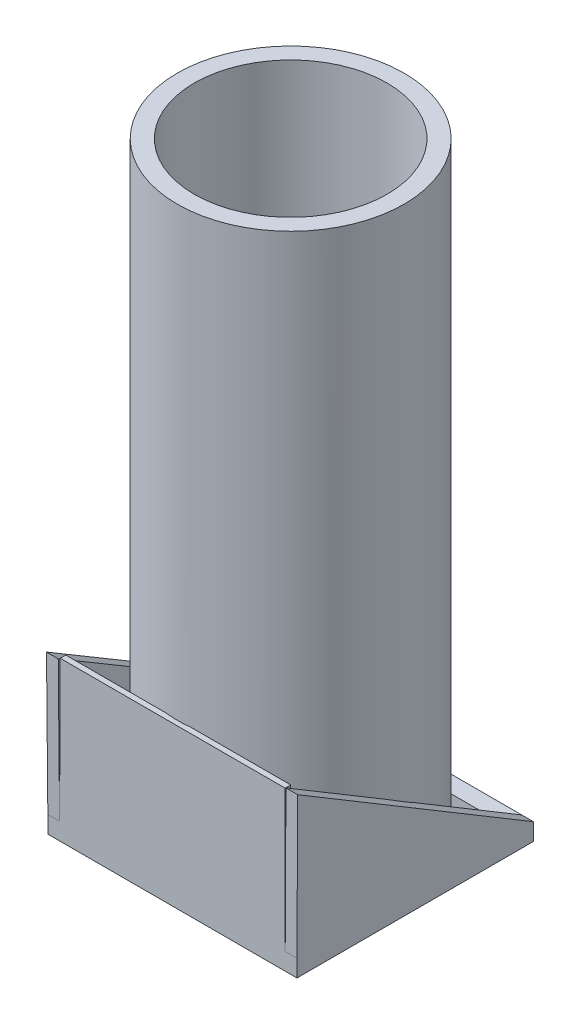
ISO-10303-21;
HEADER;
FILE_DESCRIPTION(('STEP AP214'),'2;1');
FILE_NAME('part.step','',(''),(''),'','','');
FILE_SCHEMA(('AUTOMOTIVE_DESIGN { 1 0 10303 214 1 1 1 1 }'));
ENDSEC;
DATA;
#1=APPLICATION_CONTEXT('core data for automotive mechanical design processes');
#2=APPLICATION_PROTOCOL_DEFINITION('international standard','automotive_design',2000,#1);
#3=PRODUCT_CONTEXT('',#1,'mechanical');
#4=PRODUCT('Part','Part','',(#3));
#5=PRODUCT_RELATED_PRODUCT_CATEGORY('part','',(#4));
#6=PRODUCT_DEFINITION_FORMATION('','',#4);
#7=PRODUCT_DEFINITION_CONTEXT('part definition',#1,'design');
#8=PRODUCT_DEFINITION('design','',#6,#7);
#9=PRODUCT_DEFINITION_SHAPE('','',#8);
#10=(LENGTH_UNIT() NAMED_UNIT(*) SI_UNIT(.MILLI.,.METRE.));
#11=(NAMED_UNIT(*) PLANE_ANGLE_UNIT() SI_UNIT($,.RADIAN.));
#12=(NAMED_UNIT(*) SI_UNIT($,.STERADIAN.) SOLID_ANGLE_UNIT());
#13=UNCERTAINTY_MEASURE_WITH_UNIT(LENGTH_MEASURE(1.E-05),#10,'distance_accuracy_value','');
#14=(GEOMETRIC_REPRESENTATION_CONTEXT(3) GLOBAL_UNCERTAINTY_ASSIGNED_CONTEXT((#13)) GLOBAL_UNIT_ASSIGNED_CONTEXT((#10,
#11,#12)) REPRESENTATION_CONTEXT('',''));
#15=CARTESIAN_POINT('',(0.,0.,0.));
#16=DIRECTION('',(0.,0.,1.));
#17=DIRECTION('',(1.,0.,0.));
#18=AXIS2_PLACEMENT_3D('',#15,#16,#17);
#19=CARTESIAN_POINT('',(0.,0.,0.));
#20=DIRECTION('',(0.,-1.,0.));
#21=DIRECTION('',(0.,0.,-1.));
#22=AXIS2_PLACEMENT_3D('',#19,#20,#21);
#23=PLANE('',#22);
#24=DIRECTION('',(1.,0.,0.));
#25=VECTOR('',#24,1.);
#26=CARTESIAN_POINT('',(-134.210583575948,0.,134.101535288612));
#27=LINE('',#26,#25);
#28=CARTESIAN_POINT('',(15.5492196986569,0.,134.101535288612));
#29=VERTEX_POINT('',#28);
#30=CARTESIAN_POINT('',(134.210583575948,0.,134.101535288612));
#31=VERTEX_POINT('',#30);
#32=EDGE_CURVE('E273',#29,#31,#27,.T.);
#33=ORIENTED_EDGE('',*,*,#32,.T.);
#34=DIRECTION('',(0.,0.,-1.));
#35=VECTOR('',#34,1.);
#36=CARTESIAN_POINT('',(134.210583575948,0.,140.705535288612));
#37=LINE('',#36,#35);
#38=CARTESIAN_POINT('',(134.210583575948,0.,14.5780402044796));
#39=VERTEX_POINT('',#38);
#40=EDGE_CURVE('E291',#31,#39,#37,.T.);
#41=ORIENTED_EDGE('',*,*,#40,.T.);
#42=CARTESIAN_POINT('',(0.,0.,0.));
#43=DIRECTION('',(0.,1.,0.));
#44=DIRECTION('',(0.,0.,1.));
#45=AXIS2_PLACEMENT_3D('',#42,#43,#44);
#46=CIRCLE('',#45,135.);
#47=CARTESIAN_POINT('',(127.860583575948,0.,43.3205628728202));
#48=VERTEX_POINT('',#47);
#49=EDGE_CURVE('E502',#48,#39,#46,.T.);
#50=ORIENTED_EDGE('',*,*,#49,.F.);
#51=DIRECTION('',(0.,0.,1.));
#52=VECTOR('',#51,1.);
#53=CARTESIAN_POINT('',(127.860583575948,0.,-140.705535288612));
#54=LINE('',#53,#52);
#55=CARTESIAN_POINT('',(127.860583575948,0.,120.385535288612));
#56=VERTEX_POINT('',#55);
#57=EDGE_CURVE('E399',#48,#56,#54,.T.);
#58=ORIENTED_EDGE('',*,*,#57,.T.);
#59=DIRECTION('',(-1.,0.,0.));
#60=VECTOR('',#59,1.);
#61=CARTESIAN_POINT('',(148.180583575948,0.,120.385535288612));
#62=LINE('',#61,#60);
#63=CARTESIAN_POINT('',(61.0927401028495,0.,120.385535288612));
#64=VERTEX_POINT('',#63);
#65=EDGE_CURVE('E389',#56,#64,#62,.T.);
#66=ORIENTED_EDGE('',*,*,#65,.T.);
#67=EDGE_CURVE('E497',#29,#64,#46,.T.);
#68=ORIENTED_EDGE('',*,*,#67,.F.);
#69=EDGE_LOOP('',(#33,#41,#50,#58,#66,#68));
#70=FACE_BOUND('',#69,.T.);
#71=ADVANCED_FACE('F45',(#70),#23,.F.);
#72=CARTESIAN_POINT('',(-134.210583575948,0.,134.101535288612));
#73=VERTEX_POINT('',#72);
#74=CARTESIAN_POINT('',(-15.5492196986569,0.,134.101535288612));
#75=VERTEX_POINT('',#74);
#76=EDGE_CURVE('E246',#73,#75,#27,.T.);
#77=ORIENTED_EDGE('',*,*,#76,.T.);
#78=CARTESIAN_POINT('',(-61.0927401028495,0.,120.385535288612));
#79=VERTEX_POINT('',#78);
#80=EDGE_CURVE('E503',#79,#75,#46,.T.);
#81=ORIENTED_EDGE('',*,*,#80,.F.);
#82=CARTESIAN_POINT('',(-127.860583575948,0.,120.385535288612));
#83=VERTEX_POINT('',#82);
#84=EDGE_CURVE('E394',#79,#83,#62,.T.);
#85=ORIENTED_EDGE('',*,*,#84,.T.);
#86=DIRECTION('',(0.,0.,-1.));
#87=VECTOR('',#86,1.);
#88=CARTESIAN_POINT('',(-127.860583575948,0.,-140.705535288612));
#89=LINE('',#88,#87);
#90=CARTESIAN_POINT('',(-127.860583575948,0.,43.3205628728202));
#91=VERTEX_POINT('',#90);
#92=EDGE_CURVE('E384',#83,#91,#89,.T.);
#93=ORIENTED_EDGE('',*,*,#92,.T.);
#94=CARTESIAN_POINT('',(-134.210583575948,0.,14.5780402044801));
#95=VERTEX_POINT('',#94);
#96=EDGE_CURVE('E505',#95,#91,#46,.T.);
#97=ORIENTED_EDGE('',*,*,#96,.F.);
#98=DIRECTION('',(0.,0.,-1.));
#99=VECTOR('',#98,1.);
#100=CARTESIAN_POINT('',(-134.210583575948,0.,140.705535288612));
#101=LINE('',#100,#99);
#102=EDGE_CURVE('E332',#73,#95,#101,.T.);
#103=ORIENTED_EDGE('',*,*,#102,.F.);
#104=EDGE_LOOP('',(#77,#81,#85,#93,#97,#103));
#105=FACE_BOUND('',#104,.T.);
#106=ADVANCED_FACE('F617',(#105),#23,.F.);
#107=CARTESIAN_POINT('',(0.,700.,0.));
#108=DIRECTION('',(0.,-1.,0.));
#109=DIRECTION('',(0.,0.,-1.));
#110=AXIS2_PLACEMENT_3D('',#107,#108,#109);
#111=CYLINDRICAL_SURFACE('',#110,135.);
#112=CARTESIAN_POINT('',(0.,700.,0.));
#113=DIRECTION('',(0.,1.,0.));
#114=DIRECTION('',(0.,0.,1.));
#115=AXIS2_PLACEMENT_3D('',#112,#113,#114);
#116=CIRCLE('',#115,135.);
#117=CARTESIAN_POINT('',(0.,700.,135.));
#118=VERTEX_POINT('',#117);
#119=EDGE_CURVE('E498',#118,#118,#116,.T.);
#120=ORIENTED_EDGE('',*,*,#119,.F.);
#121=EDGE_LOOP('',(#120));
#122=FACE_BOUND('',#121,.T.);
#123=DIRECTION('',(0.,-1.,0.));
#124=VECTOR('',#123,1.);
#125=CARTESIAN_POINT('',(-15.5492196986569,700.,134.101535288612));
#126=LINE('',#125,#124);
#127=CARTESIAN_POINT('',(-15.5492196986573,168.279876870145,134.101535288612));
#128=VERTEX_POINT('',#127);
#129=EDGE_CURVE('E60',#128,#75,#126,.T.);
#130=ORIENTED_EDGE('',*,*,#129,.F.);
#131=CARTESIAN_POINT('',(0.,168.279876870145,0.));
#132=DIRECTION('',(0.,1.,0.));
#133=DIRECTION('',(0.,0.,1.));
#134=AXIS2_PLACEMENT_3D('',#131,#132,#133);
#135=CIRCLE('',#134,135.);
#136=CARTESIAN_POINT('',(15.5492196986569,168.279876870145,134.101535288612));
#137=VERTEX_POINT('',#136);
#138=EDGE_CURVE('E11',#128,#137,#135,.T.);
#139=ORIENTED_EDGE('',*,*,#138,.T.);
#140=DIRECTION('',(0.,-1.,0.));
#141=VECTOR('',#140,1.);
#142=CARTESIAN_POINT('',(15.5492196986569,700.,134.101535288612));
#143=LINE('',#142,#141);
#144=EDGE_CURVE('E253',#29,#137,#143,.F.);
#145=ORIENTED_EDGE('',*,*,#144,.F.);
#146=ORIENTED_EDGE('',*,*,#67,.T.);
#147=DIRECTION('',(0.,-1.,0.));
#148=VECTOR('',#147,1.);
#149=CARTESIAN_POINT('',(61.0927401028495,700.,120.385535288612));
#150=LINE('',#149,#148);
#151=CARTESIAN_POINT('',(61.0927401028495,-20.32,120.385535288612));
#152=VERTEX_POINT('',#151);
#153=EDGE_CURVE('E437',#152,#64,#150,.F.);
#154=ORIENTED_EDGE('',*,*,#153,.F.);
#155=CARTESIAN_POINT('',(0.,-20.32,0.));
#156=DIRECTION('',(0.,-1.,0.));
#157=DIRECTION('',(0.,0.,-1.));
#158=AXIS2_PLACEMENT_3D('',#155,#156,#157);
#159=CIRCLE('',#158,135.);
#160=CARTESIAN_POINT('',(127.860583575948,-20.32,43.3205628728202));
#161=VERTEX_POINT('',#160);
#162=EDGE_CURVE('E368',#152,#161,#159,.F.);
#163=ORIENTED_EDGE('',*,*,#162,.T.);
#164=DIRECTION('',(0.,-1.,0.));
#165=VECTOR('',#164,1.);
#166=CARTESIAN_POINT('',(127.860583575948,700.,43.3205628728202));
#167=LINE('',#166,#165);
#168=EDGE_CURVE('E441',#48,#161,#167,.T.);
#169=ORIENTED_EDGE('',*,*,#168,.F.);
#170=ORIENTED_EDGE('',*,*,#49,.T.);
#171=DIRECTION('',(0.,-1.,0.));
#172=VECTOR('',#171,1.);
#173=CARTESIAN_POINT('',(134.210583575948,700.,14.5780402044796));
#174=LINE('',#173,#172);
#175=CARTESIAN_POINT('',(134.210583575948,93.0399605213853,14.5780402044796));
#176=VERTEX_POINT('',#175);
#177=EDGE_CURVE('E318',#39,#176,#174,.F.);
#178=ORIENTED_EDGE('',*,*,#177,.T.);
#179=CARTESIAN_POINT('',(0.,84.3053581605304,0.));
#180=DIRECTION('',(0.,0.85781003933585,-0.513966863148421));
#181=DIRECTION('',(0.,-0.513966863148421,-0.85781003933585));
#182=AXIS2_PLACEMENT_3D('',#179,#180,#181);
#183=ELLIPSE('',#182,157.377500623008,135.);
#184=CARTESIAN_POINT('',(134.210583575948,75.5707557996754,-14.5780402044796));
#185=VERTEX_POINT('',#184);
#186=EDGE_CURVE('E311',#176,#185,#183,.T.);
#187=ORIENTED_EDGE('',*,*,#186,.T.);
#188=DIRECTION('',(0.,-1.,0.));
#189=VECTOR('',#188,1.);
#190=CARTESIAN_POINT('',(134.210583575948,700.,-14.5780402044796));
#191=LINE('',#190,#189);
#192=CARTESIAN_POINT('',(134.210583575948,0.,-14.5780402044796));
#193=VERTEX_POINT('',#192);
#194=EDGE_CURVE('E322',#185,#193,#191,.T.);
#195=ORIENTED_EDGE('',*,*,#194,.T.);
#196=CARTESIAN_POINT('',(127.860583575948,0.,-43.3205628728202));
#197=VERTEX_POINT('',#196);
#198=EDGE_CURVE('E557',#193,#197,#46,.T.);
#199=ORIENTED_EDGE('',*,*,#198,.T.);
#200=DIRECTION('',(0.,-1.,0.));
#201=VECTOR('',#200,1.);
#202=CARTESIAN_POINT('',(127.860583575948,700.,-43.3205628728202));
#203=LINE('',#202,#201);
#204=CARTESIAN_POINT('',(127.860583575948,-20.32,-43.3205628728202));
#205=VERTEX_POINT('',#204);
#206=EDGE_CURVE('E444',#205,#197,#203,.F.);
#207=ORIENTED_EDGE('',*,*,#206,.F.);
#208=CARTESIAN_POINT('',(61.0927401028495,-20.32,-120.385535288612));
#209=VERTEX_POINT('',#208);
#210=EDGE_CURVE('E362',#205,#209,#159,.F.);
#211=ORIENTED_EDGE('',*,*,#210,.T.);
#212=DIRECTION('',(0.,-1.,0.));
#213=VECTOR('',#212,1.);
#214=CARTESIAN_POINT('',(61.0927401028495,700.,-120.385535288612));
#215=LINE('',#214,#213);
#216=CARTESIAN_POINT('',(61.0927401028495,0.,-120.385535288612));
#217=VERTEX_POINT('',#216);
#218=EDGE_CURVE('E373',#209,#217,#215,.F.);
#219=ORIENTED_EDGE('',*,*,#218,.T.);
#220=CARTESIAN_POINT('',(-61.0927401028495,0.,-120.385535288612));
#221=VERTEX_POINT('',#220);
#222=EDGE_CURVE('E559',#217,#221,#46,.T.);
#223=ORIENTED_EDGE('',*,*,#222,.T.);
#224=DIRECTION('',(0.,-1.,0.));
#225=VECTOR('',#224,1.);
#226=CARTESIAN_POINT('',(-61.0927401028495,700.,-120.385535288612));
#227=LINE('',#226,#225);
#228=CARTESIAN_POINT('',(-61.0927401028495,-20.32,-120.385535288612));
#229=VERTEX_POINT('',#228);
#230=EDGE_CURVE('E424',#221,#229,#227,.T.);
#231=ORIENTED_EDGE('',*,*,#230,.T.);
#232=CARTESIAN_POINT('',(-127.860583575948,-20.32,-43.3205628728202));
#233=VERTEX_POINT('',#232);
#234=EDGE_CURVE('E363',#229,#233,#159,.F.);
#235=ORIENTED_EDGE('',*,*,#234,.T.);
#236=DIRECTION('',(0.,-1.,0.));
#237=VECTOR('',#236,1.);
#238=CARTESIAN_POINT('',(-127.860583575948,700.,-43.3205628728202));
#239=LINE('',#238,#237);
#240=CARTESIAN_POINT('',(-127.860583575948,0.,-43.3205628728202));
#241=VERTEX_POINT('',#240);
#242=EDGE_CURVE('E427',#233,#241,#239,.F.);
#243=ORIENTED_EDGE('',*,*,#242,.T.);
#244=CARTESIAN_POINT('',(-134.210583575948,0.,-14.5780402044801));
#245=VERTEX_POINT('',#244);
#246=EDGE_CURVE('E564',#241,#245,#46,.T.);
#247=ORIENTED_EDGE('',*,*,#246,.T.);
#248=DIRECTION('',(0.,-1.,0.));
#249=VECTOR('',#248,1.);
#250=CARTESIAN_POINT('',(-134.210583575948,700.,-14.5780402044807));
#251=LINE('',#250,#249);
#252=CARTESIAN_POINT('',(-134.210583575948,74.9207892330315,-14.5780402044807));
#253=VERTEX_POINT('',#252);
#254=EDGE_CURVE('E356',#253,#245,#251,.T.);
#255=ORIENTED_EDGE('',*,*,#254,.F.);
#256=CARTESIAN_POINT('',(0.,83.5802673021238,0.));
#257=DIRECTION('',(0.,-0.859757208702279,0.510702988129565));
#258=DIRECTION('',(0.,-0.510702988129565,-0.859757208702279));
#259=AXIS2_PLACEMENT_3D('',#256,#257,#258);
#260=ELLIPSE('',#259,157.021073663075,135.);
#261=CARTESIAN_POINT('',(-134.210583575948,92.2397453712157,14.5780402044807));
#262=VERTEX_POINT('',#261);
#263=EDGE_CURVE('E359',#262,#253,#260,.T.);
#264=ORIENTED_EDGE('',*,*,#263,.F.);
#265=DIRECTION('',(0.,-1.,0.));
#266=VECTOR('',#265,1.);
#267=CARTESIAN_POINT('',(-134.210583575948,700.,14.5780402044807));
#268=LINE('',#267,#266);
#269=EDGE_CURVE('E353',#95,#262,#268,.F.);
#270=ORIENTED_EDGE('',*,*,#269,.F.);
#271=ORIENTED_EDGE('',*,*,#96,.T.);
#272=DIRECTION('',(0.,-1.,0.));
#273=VECTOR('',#272,1.);
#274=CARTESIAN_POINT('',(-127.860583575948,700.,43.3205628728202));
#275=LINE('',#274,#273);
#276=CARTESIAN_POINT('',(-127.860583575948,-20.32,43.3205628728202));
#277=VERTEX_POINT('',#276);
#278=EDGE_CURVE('E430',#91,#277,#275,.T.);
#279=ORIENTED_EDGE('',*,*,#278,.T.);
#280=CARTESIAN_POINT('',(0.,-20.32,0.));
#281=DIRECTION('',(0.,-1.,0.));
#282=DIRECTION('',(0.,0.,-1.));
#283=AXIS2_PLACEMENT_3D('',#280,#281,#282);
#284=CIRCLE('',#283,135.);
#285=CARTESIAN_POINT('',(-61.0927401028495,-20.32,120.385535288612));
#286=VERTEX_POINT('',#285);
#287=EDGE_CURVE('E448',#277,#286,#284,.F.);
#288=ORIENTED_EDGE('',*,*,#287,.T.);
#289=DIRECTION('',(0.,-1.,0.));
#290=VECTOR('',#289,1.);
#291=CARTESIAN_POINT('',(-61.0927401028495,700.,120.385535288612));
#292=LINE('',#291,#290);
#293=EDGE_CURVE('E433',#79,#286,#292,.T.);
#294=ORIENTED_EDGE('',*,*,#293,.F.);
#295=ORIENTED_EDGE('',*,*,#80,.T.);
#296=EDGE_LOOP('',(#130,#139,#145,#146,#154,#163,#169,#170,#178,#187,#195,#199,#207,#211,#219,
#223,#231,#235,#243,#247,#255,#264,#270,#271,#279,#288,#294,#295));
#297=FACE_BOUND('',#296,.T.);
#298=ADVANCED_FACE('F47',(#122,#297),#111,.T.);
#299=ORIENTED_EDGE('',*,*,#198,.F.);
#300=CARTESIAN_POINT('',(134.210583575948,0.,-140.705535288612));
#301=VERTEX_POINT('',#300);
#302=EDGE_CURVE('E292',#193,#301,#37,.T.);
#303=ORIENTED_EDGE('',*,*,#302,.T.);
#304=DIRECTION('',(1.,0.,0.));
#305=VECTOR('',#304,1.);
#306=CARTESIAN_POINT('',(148.180583575948,0.,-140.705535288612));
#307=LINE('',#306,#305);
#308=CARTESIAN_POINT('',(-134.210583575948,0.,-140.705535288612));
#309=VERTEX_POINT('',#308);
#310=EDGE_CURVE('E459',#309,#301,#307,.T.);
#311=ORIENTED_EDGE('',*,*,#310,.F.);
#312=DIRECTION('',(0.,0.,-1.));
#313=VECTOR('',#312,1.);
#314=CARTESIAN_POINT('',(-134.210583575948,0.,0.));
#315=LINE('',#314,#313);
#316=EDGE_CURVE('E54',#245,#309,#315,.T.);
#317=ORIENTED_EDGE('',*,*,#316,.F.);
#318=ORIENTED_EDGE('',*,*,#246,.F.);
#319=CARTESIAN_POINT('',(-127.860583575948,0.,-120.385535288612));
#320=VERTEX_POINT('',#319);
#321=EDGE_CURVE('E367',#241,#320,#89,.T.);
#322=ORIENTED_EDGE('',*,*,#321,.T.);
#323=DIRECTION('',(1.,0.,0.));
#324=VECTOR('',#323,1.);
#325=CARTESIAN_POINT('',(148.180583575948,0.,-120.385535288612));
#326=LINE('',#325,#324);
#327=EDGE_CURVE('E400',#320,#221,#326,.T.);
#328=ORIENTED_EDGE('',*,*,#327,.T.);
#329=ORIENTED_EDGE('',*,*,#222,.F.);
#330=CARTESIAN_POINT('',(127.860583575948,0.,-120.385535288612));
#331=VERTEX_POINT('',#330);
#332=EDGE_CURVE('E388',#217,#331,#326,.T.);
#333=ORIENTED_EDGE('',*,*,#332,.T.);
#334=EDGE_CURVE('E395',#331,#197,#54,.T.);
#335=ORIENTED_EDGE('',*,*,#334,.T.);
#336=EDGE_LOOP('',(#299,#303,#311,#317,#318,#322,#328,#329,#333,#335));
#337=FACE_BOUND('',#336,.T.);
#338=ADVANCED_FACE('F524',(#337),#23,.F.);
#339=CARTESIAN_POINT('',(0.,700.,0.));
#340=DIRECTION('',(0.,1.,0.));
#341=DIRECTION('',(0.,0.,1.));
#342=AXIS2_PLACEMENT_3D('',#339,#340,#341);
#343=PLANE('',#342);
#344=CARTESIAN_POINT('',(0.,700.,0.));
#345=DIRECTION('',(0.,1.,0.));
#346=DIRECTION('',(0.,0.,1.));
#347=AXIS2_PLACEMENT_3D('',#344,#345,#346);
#348=CIRCLE('',#347,114.68);
#349=CARTESIAN_POINT('',(0.,700.,114.68));
#350=VERTEX_POINT('',#349);
#351=EDGE_CURVE('E451',#350,#350,#348,.T.);
#352=ORIENTED_EDGE('',*,*,#351,.F.);
#353=EDGE_LOOP('',(#352));
#354=FACE_BOUND('',#353,.T.);
#355=ORIENTED_EDGE('',*,*,#119,.T.);
#356=EDGE_LOOP('',(#355));
#357=FACE_BOUND('',#356,.T.);
#358=ADVANCED_FACE('F626',(#354,#357),#343,.T.);
#359=CARTESIAN_POINT('',(-148.180583575948,-20.32,-140.705535288612));
#360=DIRECTION('',(1.,0.,0.));
#361=DIRECTION('',(0.,0.,-1.));
#362=AXIS2_PLACEMENT_3D('',#359,#360,#361);
#363=PLANE('',#362);
#364=DIRECTION('',(0.,1.,0.));
#365=VECTOR('',#364,1.);
#366=CARTESIAN_POINT('',(-148.180583575948,-20.32,140.705535288612));
#367=LINE('',#366,#365);
#368=CARTESIAN_POINT('',(-148.180583575948,-20.32,140.705535288612));
#369=VERTEX_POINT('',#368);
#370=CARTESIAN_POINT('',(-148.180583575948,0.,140.705535288612));
#371=VERTEX_POINT('',#370);
#372=EDGE_CURVE('E474',#369,#371,#367,.T.);
#373=ORIENTED_EDGE('',*,*,#372,.T.);
#374=DIRECTION('',(0.,-0.999954995636517,-0.00948718617789102));
#375=VECTOR('',#374,1.);
#376=CARTESIAN_POINT('',(-148.180583575948,168.1079442,142.300478432621));
#377=LINE('',#376,#375);
#378=CARTESIAN_POINT('',(-148.180583575948,168.1079442,142.300478432621));
#379=VERTEX_POINT('',#378);
#380=EDGE_CURVE('E343',#379,#371,#377,.T.);
#381=ORIENTED_EDGE('',*,*,#380,.F.);
#382=DIRECTION('',(0.,0.510702988129565,0.859757208702279));
#383=VECTOR('',#382,1.);
#384=CARTESIAN_POINT('',(-148.180583575948,0.,-140.705535288612));
#385=LINE('',#384,#383);
#386=CARTESIAN_POINT('',(-148.180583575948,0.,-140.705535288612));
#387=VERTEX_POINT('',#386);
#388=EDGE_CURVE('E326',#387,#379,#385,.T.);
#389=ORIENTED_EDGE('',*,*,#388,.F.);
#390=DIRECTION('',(0.,1.,0.));
#391=VECTOR('',#390,1.);
#392=CARTESIAN_POINT('',(-148.180583575948,-20.32,-140.705535288612));
#393=LINE('',#392,#391);
#394=CARTESIAN_POINT('',(-148.180583575948,-20.32,-140.705535288612));
#395=VERTEX_POINT('',#394);
#396=EDGE_CURVE('E493',#395,#387,#393,.T.);
#397=ORIENTED_EDGE('',*,*,#396,.F.);
#398=DIRECTION('',(0.,0.,-1.));
#399=VECTOR('',#398,1.);
#400=CARTESIAN_POINT('',(-148.180583575948,-20.32,-140.705535288612));
#401=LINE('',#400,#399);
#402=EDGE_CURVE('E460',#369,#395,#401,.T.);
#403=ORIENTED_EDGE('',*,*,#402,.F.);
#404=EDGE_LOOP('',(#373,#381,#389,#397,#403));
#405=FACE_BOUND('',#404,.T.);
#406=ADVANCED_FACE('F532',(#405),#363,.F.);
#407=CARTESIAN_POINT('',(148.180583575948,-20.32,-140.705535288612));
#408=DIRECTION('',(0.,0.,1.));
#409=DIRECTION('',(1.,0.,0.));
#410=AXIS2_PLACEMENT_3D('',#407,#408,#409);
#411=PLANE('',#410);
#412=EDGE_CURVE('E475',#387,#309,#307,.T.);
#413=ORIENTED_EDGE('',*,*,#412,.T.);
#414=ORIENTED_EDGE('',*,*,#310,.T.);
#415=DIRECTION('',(1.,0.,0.));
#416=VECTOR('',#415,1.);
#417=CARTESIAN_POINT('',(134.210583575948,0.,-140.705535288612));
#418=LINE('',#417,#416);
#419=CARTESIAN_POINT('',(148.180583575948,0.,-140.705535288612));
#420=VERTEX_POINT('',#419);
#421=EDGE_CURVE('E300',#301,#420,#418,.T.);
#422=ORIENTED_EDGE('',*,*,#421,.T.);
#423=DIRECTION('',(0.,1.,0.));
#424=VECTOR('',#423,1.);
#425=CARTESIAN_POINT('',(148.180583575948,-20.32,-140.705535288612));
#426=LINE('',#425,#424);
#427=CARTESIAN_POINT('',(148.180583575948,-20.32,-140.705535288612));
#428=VERTEX_POINT('',#427);
#429=EDGE_CURVE('E489',#428,#420,#426,.T.);
#430=ORIENTED_EDGE('',*,*,#429,.F.);
#431=DIRECTION('',(1.,0.,0.));
#432=VECTOR('',#431,1.);
#433=CARTESIAN_POINT('',(148.180583575948,-20.32,-140.705535288612));
#434=LINE('',#433,#432);
#435=EDGE_CURVE('E464',#395,#428,#434,.T.);
#436=ORIENTED_EDGE('',*,*,#435,.F.);
#437=ORIENTED_EDGE('',*,*,#396,.T.);
#438=EDGE_LOOP('',(#413,#414,#422,#430,#436,#437));
#439=FACE_BOUND('',#438,.T.);
#440=ADVANCED_FACE('F527',(#439),#411,.F.);
#441=CARTESIAN_POINT('',(148.180583575948,-20.32,-140.705535288612));
#442=DIRECTION('',(-1.,0.,0.));
#443=DIRECTION('',(0.,0.,1.));
#444=AXIS2_PLACEMENT_3D('',#441,#442,#443);
#445=PLANE('',#444);
#446=ORIENTED_EDGE('',*,*,#429,.T.);
#447=DIRECTION('',(0.,0.513966863148421,0.85781003933585));
#448=VECTOR('',#447,1.);
#449=CARTESIAN_POINT('',(148.180583575948,0.,-140.705535288612));
#450=LINE('',#449,#448);
#451=CARTESIAN_POINT('',(148.180583575948,168.107944167296,139.866409204966));
#452=VERTEX_POINT('',#451);
#453=EDGE_CURVE('E287',#420,#452,#450,.T.);
#454=ORIENTED_EDGE('',*,*,#453,.T.);
#455=DIRECTION('',(0.,-0.999987542242961,0.00499152871194512));
#456=VECTOR('',#455,1.);
#457=CARTESIAN_POINT('',(148.180583575948,168.107944167296,139.866409204966));
#458=LINE('',#457,#456);
#459=CARTESIAN_POINT('',(148.180583575948,0.,140.705535288612));
#460=VERTEX_POINT('',#459);
#461=EDGE_CURVE('E304',#452,#460,#458,.T.);
#462=ORIENTED_EDGE('',*,*,#461,.T.);
#463=DIRECTION('',(0.,1.,0.));
#464=VECTOR('',#463,1.);
#465=CARTESIAN_POINT('',(148.180583575948,-20.32,140.705535288612));
#466=LINE('',#465,#464);
#467=CARTESIAN_POINT('',(148.180583575948,-20.32,140.705535288612));
#468=VERTEX_POINT('',#467);
#469=EDGE_CURVE('E485',#468,#460,#466,.T.);
#470=ORIENTED_EDGE('',*,*,#469,.F.);
#471=DIRECTION('',(0.,0.,1.));
#472=VECTOR('',#471,1.);
#473=CARTESIAN_POINT('',(148.180583575948,-20.32,-140.705535288612));
#474=LINE('',#473,#472);
#475=EDGE_CURVE('E468',#428,#468,#474,.T.);
#476=ORIENTED_EDGE('',*,*,#475,.F.);
#477=EDGE_LOOP('',(#446,#454,#462,#470,#476));
#478=FACE_BOUND('',#477,.T.);
#479=ADVANCED_FACE('F652',(#478),#445,.F.);
#480=CARTESIAN_POINT('',(148.180583575948,-20.32,140.705535288612));
#481=DIRECTION('',(0.,0.,-1.));
#482=DIRECTION('',(-1.,0.,0.));
#483=AXIS2_PLACEMENT_3D('',#480,#481,#482);
#484=PLANE('',#483);
#485=DIRECTION('',(-1.,0.,0.));
#486=VECTOR('',#485,1.);
#487=CARTESIAN_POINT('',(148.180583575948,0.,140.705535288612));
#488=LINE('',#487,#486);
#489=CARTESIAN_POINT('',(134.210583575948,0.,140.705535288612));
#490=VERTEX_POINT('',#489);
#491=EDGE_CURVE('E465',#460,#490,#488,.T.);
#492=ORIENTED_EDGE('',*,*,#491,.T.);
#493=DIRECTION('',(-0.00028783757142871,0.999999958574765,0.));
#494=VECTOR('',#493,1.);
#495=CARTESIAN_POINT('',(134.210583575948,0.,140.705535288612));
#496=LINE('',#495,#494);
#497=CARTESIAN_POINT('',(134.162146302863,168.279876870145,140.705535288612));
#498=VERTEX_POINT('',#497);
#499=EDGE_CURVE('E276',#490,#498,#496,.T.);
#500=ORIENTED_EDGE('',*,*,#499,.T.);
#501=DIRECTION('',(-1.,0.,0.));
#502=VECTOR('',#501,1.);
#503=CARTESIAN_POINT('',(134.162146302863,168.279876870145,140.705535288612));
#504=LINE('',#503,#502);
#505=CARTESIAN_POINT('',(-133.500855759436,168.279876870145,140.705535288612));
#506=VERTEX_POINT('',#505);
#507=EDGE_CURVE('E239',#498,#506,#504,.T.);
#508=ORIENTED_EDGE('',*,*,#507,.T.);
#509=DIRECTION('',(-0.00421750667751213,-0.999991106279164,0.));
#510=VECTOR('',#509,1.);
#511=CARTESIAN_POINT('',(-133.500855759436,168.279876870145,140.705535288612));
#512=LINE('',#511,#510);
#513=CARTESIAN_POINT('',(-134.210583575948,0.,140.705535288612));
#514=VERTEX_POINT('',#513);
#515=EDGE_CURVE('E263',#506,#514,#512,.T.);
#516=ORIENTED_EDGE('',*,*,#515,.T.);
#517=DIRECTION('',(-1.,0.,0.));
#518=VECTOR('',#517,1.);
#519=CARTESIAN_POINT('',(-134.210583575948,0.,140.705535288612));
#520=LINE('',#519,#518);
#521=EDGE_CURVE('E340',#514,#371,#520,.T.);
#522=ORIENTED_EDGE('',*,*,#521,.T.);
#523=ORIENTED_EDGE('',*,*,#372,.F.);
#524=DIRECTION('',(-1.,0.,0.));
#525=VECTOR('',#524,1.);
#526=CARTESIAN_POINT('',(148.180583575948,-20.32,140.705535288612));
#527=LINE('',#526,#525);
#528=EDGE_CURVE('E471',#468,#369,#527,.T.);
#529=ORIENTED_EDGE('',*,*,#528,.F.);
#530=ORIENTED_EDGE('',*,*,#469,.T.);
#531=EDGE_LOOP('',(#492,#500,#508,#516,#522,#523,#529,#530));
#532=FACE_BOUND('',#531,.T.);
#533=ADVANCED_FACE('F646',(#532),#484,.F.);
#534=CARTESIAN_POINT('',(0.,-20.32,0.));
#535=DIRECTION('',(0.,-1.,0.));
#536=DIRECTION('',(0.,0.,-1.));
#537=AXIS2_PLACEMENT_3D('',#534,#535,#536);
#538=PLANE('',#537);
#539=DIRECTION('',(0.,0.,-1.));
#540=VECTOR('',#539,1.);
#541=CARTESIAN_POINT('',(-127.860583575948,-20.32,-140.705535288612));
#542=LINE('',#541,#540);
#543=CARTESIAN_POINT('',(-127.860583575948,-20.32,120.385535288612));
#544=VERTEX_POINT('',#543);
#545=EDGE_CURVE('E404',#544,#277,#542,.T.);
#546=ORIENTED_EDGE('',*,*,#545,.F.);
#547=DIRECTION('',(-1.,0.,0.));
#548=VECTOR('',#547,1.);
#549=CARTESIAN_POINT('',(148.180583575948,-20.32,120.385535288612));
#550=LINE('',#549,#548);
#551=EDGE_CURVE('E418',#286,#544,#550,.T.);
#552=ORIENTED_EDGE('',*,*,#551,.F.);
#553=ORIENTED_EDGE('',*,*,#287,.F.);
#554=EDGE_LOOP('',(#546,#552,#553));
#555=FACE_BOUND('',#554,.T.);
#556=ORIENTED_EDGE('',*,*,#234,.F.);
#557=DIRECTION('',(1.,0.,0.));
#558=VECTOR('',#557,1.);
#559=CARTESIAN_POINT('',(148.180583575948,-20.32,-120.385535288612));
#560=LINE('',#559,#558);
#561=CARTESIAN_POINT('',(-127.860583575948,-20.32,-120.385535288612));
#562=VERTEX_POINT('',#561);
#563=EDGE_CURVE('E409',#562,#229,#560,.T.);
#564=ORIENTED_EDGE('',*,*,#563,.F.);
#565=EDGE_CURVE('E393',#233,#562,#542,.T.);
#566=ORIENTED_EDGE('',*,*,#565,.F.);
#567=EDGE_LOOP('',(#556,#564,#566));
#568=FACE_BOUND('',#567,.T.);
#569=ORIENTED_EDGE('',*,*,#210,.F.);
#570=DIRECTION('',(0.,0.,1.));
#571=VECTOR('',#570,1.);
#572=CARTESIAN_POINT('',(127.860583575948,-20.32,-140.705535288612));
#573=LINE('',#572,#571);
#574=CARTESIAN_POINT('',(127.860583575948,-20.32,-120.385535288612));
#575=VERTEX_POINT('',#574);
#576=EDGE_CURVE('E414',#575,#205,#573,.T.);
#577=ORIENTED_EDGE('',*,*,#576,.F.);
#578=EDGE_CURVE('E408',#209,#575,#560,.T.);
#579=ORIENTED_EDGE('',*,*,#578,.F.);
#580=EDGE_LOOP('',(#569,#577,#579));
#581=FACE_BOUND('',#580,.T.);
#582=ORIENTED_EDGE('',*,*,#162,.F.);
#583=CARTESIAN_POINT('',(127.860583575948,-20.32,120.385535288612));
#584=VERTEX_POINT('',#583);
#585=EDGE_CURVE('E379',#584,#152,#550,.T.);
#586=ORIENTED_EDGE('',*,*,#585,.F.);
#587=EDGE_CURVE('E413',#161,#584,#573,.T.);
#588=ORIENTED_EDGE('',*,*,#587,.F.);
#589=EDGE_LOOP('',(#582,#586,#588));
#590=FACE_BOUND('',#589,.T.);
#591=ORIENTED_EDGE('',*,*,#402,.T.);
#592=ORIENTED_EDGE('',*,*,#435,.T.);
#593=ORIENTED_EDGE('',*,*,#475,.T.);
#594=ORIENTED_EDGE('',*,*,#528,.T.);
#595=EDGE_LOOP('',(#591,#592,#593,#594));
#596=FACE_BOUND('',#595,.T.);
#597=ADVANCED_FACE('F585',(#555,#568,#581,#590,#596),#538,.T.);
#598=CARTESIAN_POINT('',(0.,700.,0.));
#599=DIRECTION('',(0.,-1.,0.));
#600=DIRECTION('',(0.,0.,-1.));
#601=AXIS2_PLACEMENT_3D('',#598,#599,#600);
#602=CYLINDRICAL_SURFACE('',#601,114.68);
#603=ORIENTED_EDGE('',*,*,#351,.T.);
#604=EDGE_LOOP('',(#603));
#605=FACE_BOUND('',#604,.T.);
#606=CARTESIAN_POINT('',(0.,0.,0.));
#607=DIRECTION('',(0.,-1.,0.));
#608=DIRECTION('',(0.,0.,-1.));
#609=AXIS2_PLACEMENT_3D('',#606,#607,#608);
#610=CIRCLE('',#609,114.68);
#611=CARTESIAN_POINT('',(0.,0.,-114.68));
#612=VERTEX_POINT('',#611);
#613=EDGE_CURVE('E455',#612,#612,#610,.F.);
#614=ORIENTED_EDGE('',*,*,#613,.F.);
#615=EDGE_LOOP('',(#614));
#616=FACE_BOUND('',#615,.T.);
#617=ADVANCED_FACE('F877',(#605,#616),#602,.F.);
#618=CARTESIAN_POINT('',(0.,0.,0.));
#619=DIRECTION('',(0.,-1.,0.));
#620=DIRECTION('',(0.,0.,-1.));
#621=AXIS2_PLACEMENT_3D('',#618,#619,#620);
#622=PLANE('',#621);
#623=ORIENTED_EDGE('',*,*,#613,.T.);
#624=EDGE_LOOP('',(#623));
#625=FACE_BOUND('',#624,.T.);
#626=ADVANCED_FACE('F831',(#625),#622,.F.);
#627=CARTESIAN_POINT('',(-127.860583575948,-20.32,-140.705535288612));
#628=DIRECTION('',(1.,0.,0.));
#629=DIRECTION('',(0.,0.,-1.));
#630=AXIS2_PLACEMENT_3D('',#627,#628,#629);
#631=PLANE('',#630);
#632=ORIENTED_EDGE('',*,*,#92,.F.);
#633=DIRECTION('',(0.,1.,0.));
#634=VECTOR('',#633,1.);
#635=CARTESIAN_POINT('',(-127.860583575948,-20.32,120.385535288612));
#636=LINE('',#635,#634);
#637=EDGE_CURVE('E375',#544,#83,#636,.T.);
#638=ORIENTED_EDGE('',*,*,#637,.F.);
#639=ORIENTED_EDGE('',*,*,#545,.T.);
#640=ORIENTED_EDGE('',*,*,#278,.F.);
#641=EDGE_LOOP('',(#632,#638,#639,#640));
#642=FACE_BOUND('',#641,.T.);
#643=ADVANCED_FACE('F824',(#642),#631,.T.);
#644=CARTESIAN_POINT('',(148.180583575948,-20.32,120.385535288612));
#645=DIRECTION('',(0.,0.,-1.));
#646=DIRECTION('',(-1.,0.,0.));
#647=AXIS2_PLACEMENT_3D('',#644,#645,#646);
#648=PLANE('',#647);
#649=ORIENTED_EDGE('',*,*,#293,.T.);
#650=ORIENTED_EDGE('',*,*,#551,.T.);
#651=ORIENTED_EDGE('',*,*,#637,.T.);
#652=ORIENTED_EDGE('',*,*,#84,.F.);
#653=EDGE_LOOP('',(#649,#650,#651,#652));
#654=FACE_BOUND('',#653,.T.);
#655=ADVANCED_FACE('F819',(#654),#648,.T.);
#656=ORIENTED_EDGE('',*,*,#153,.T.);
#657=ORIENTED_EDGE('',*,*,#65,.F.);
#658=DIRECTION('',(0.,1.,0.));
#659=VECTOR('',#658,1.);
#660=CARTESIAN_POINT('',(127.860583575948,-20.32,120.385535288612));
#661=LINE('',#660,#659);
#662=EDGE_CURVE('E378',#584,#56,#661,.T.);
#663=ORIENTED_EDGE('',*,*,#662,.F.);
#664=ORIENTED_EDGE('',*,*,#585,.T.);
#665=EDGE_LOOP('',(#656,#657,#663,#664));
#666=FACE_BOUND('',#665,.T.);
#667=ADVANCED_FACE('F614',(#666),#648,.T.);
#668=CARTESIAN_POINT('',(127.860583575948,-20.32,-140.705535288612));
#669=DIRECTION('',(-1.,0.,0.));
#670=DIRECTION('',(0.,0.,1.));
#671=AXIS2_PLACEMENT_3D('',#668,#669,#670);
#672=PLANE('',#671);
#673=ORIENTED_EDGE('',*,*,#168,.T.);
#674=ORIENTED_EDGE('',*,*,#587,.T.);
#675=ORIENTED_EDGE('',*,*,#662,.T.);
#676=ORIENTED_EDGE('',*,*,#57,.F.);
#677=EDGE_LOOP('',(#673,#674,#675,#676));
#678=FACE_BOUND('',#677,.T.);
#679=ADVANCED_FACE('F603',(#678),#672,.T.);
#680=CARTESIAN_POINT('',(148.180583575948,-20.32,-120.385535288612));
#681=DIRECTION('',(0.,0.,1.));
#682=DIRECTION('',(1.,0.,0.));
#683=AXIS2_PLACEMENT_3D('',#680,#681,#682);
#684=PLANE('',#683);
#685=ORIENTED_EDGE('',*,*,#578,.T.);
#686=DIRECTION('',(0.,1.,0.));
#687=VECTOR('',#686,1.);
#688=CARTESIAN_POINT('',(127.860583575948,-20.32,-120.385535288612));
#689=LINE('',#688,#687);
#690=EDGE_CURVE('E374',#575,#331,#689,.T.);
#691=ORIENTED_EDGE('',*,*,#690,.T.);
#692=ORIENTED_EDGE('',*,*,#332,.F.);
#693=ORIENTED_EDGE('',*,*,#218,.F.);
#694=EDGE_LOOP('',(#685,#691,#692,#693));
#695=FACE_BOUND('',#694,.T.);
#696=ADVANCED_FACE('F597',(#695),#684,.T.);
#697=ORIENTED_EDGE('',*,*,#206,.T.);
#698=ORIENTED_EDGE('',*,*,#334,.F.);
#699=ORIENTED_EDGE('',*,*,#690,.F.);
#700=ORIENTED_EDGE('',*,*,#576,.T.);
#701=EDGE_LOOP('',(#697,#698,#699,#700));
#702=FACE_BOUND('',#701,.T.);
#703=ADVANCED_FACE('F599',(#702),#672,.T.);
#704=ORIENTED_EDGE('',*,*,#327,.F.);
#705=DIRECTION('',(0.,1.,0.));
#706=VECTOR('',#705,1.);
#707=CARTESIAN_POINT('',(-127.860583575948,-20.32,-120.385535288612));
#708=LINE('',#707,#706);
#709=EDGE_CURVE('E369',#562,#320,#708,.T.);
#710=ORIENTED_EDGE('',*,*,#709,.F.);
#711=ORIENTED_EDGE('',*,*,#563,.T.);
#712=ORIENTED_EDGE('',*,*,#230,.F.);
#713=EDGE_LOOP('',(#704,#710,#711,#712));
#714=FACE_BOUND('',#713,.T.);
#715=ADVANCED_FACE('F601',(#714),#684,.T.);
#716=ORIENTED_EDGE('',*,*,#565,.T.);
#717=ORIENTED_EDGE('',*,*,#709,.T.);
#718=ORIENTED_EDGE('',*,*,#321,.F.);
#719=ORIENTED_EDGE('',*,*,#242,.F.);
#720=EDGE_LOOP('',(#716,#717,#718,#719));
#721=FACE_BOUND('',#720,.T.);
#722=ADVANCED_FACE('F608',(#721),#631,.T.);
#723=CARTESIAN_POINT('',(-134.210583575948,0.,-140.705535288612));
#724=DIRECTION('',(0.,-0.859757208702279,0.510702988129565));
#725=DIRECTION('',(0.,-0.510702988129565,-0.859757208702279));
#726=AXIS2_PLACEMENT_3D('',#723,#724,#725);
#727=PLANE('',#726);
#728=DIRECTION('',(0.,0.510702988129565,0.859757208702279));
#729=VECTOR('',#728,1.);
#730=CARTESIAN_POINT('',(-134.210583575948,0.,-140.705535288612));
#731=LINE('',#730,#729);
#732=CARTESIAN_POINT('',(-134.210583575948,168.1079442,142.300478432621));
#733=VERTEX_POINT('',#732);
#734=EDGE_CURVE('E331',#262,#733,#731,.T.);
#735=ORIENTED_EDGE('',*,*,#734,.F.);
#736=ORIENTED_EDGE('',*,*,#263,.T.);
#737=EDGE_CURVE('E333',#309,#253,#731,.T.);
#738=ORIENTED_EDGE('',*,*,#737,.F.);
#739=ORIENTED_EDGE('',*,*,#412,.F.);
#740=ORIENTED_EDGE('',*,*,#388,.T.);
#741=DIRECTION('',(-1.,0.,0.));
#742=VECTOR('',#741,1.);
#743=CARTESIAN_POINT('',(-134.210583575948,168.1079442,142.300478432621));
#744=LINE('',#743,#742);
#745=EDGE_CURVE('E349',#733,#379,#744,.T.);
#746=ORIENTED_EDGE('',*,*,#745,.F.);
#747=EDGE_LOOP('',(#735,#736,#738,#739,#740,#746));
#748=FACE_BOUND('',#747,.T.);
#749=ADVANCED_FACE('F518',(#748),#727,.F.);
#750=CARTESIAN_POINT('',(-134.210583575948,0.,0.));
#751=DIRECTION('',(-1.,0.,0.));
#752=DIRECTION('',(0.,0.,1.));
#753=AXIS2_PLACEMENT_3D('',#750,#751,#752);
#754=PLANE('',#753);
#755=ORIENTED_EDGE('',*,*,#737,.T.);
#756=ORIENTED_EDGE('',*,*,#254,.T.);
#757=ORIENTED_EDGE('',*,*,#316,.T.);
#758=EDGE_LOOP('',(#755,#756,#757));
#759=FACE_BOUND('',#758,.T.);
#760=ADVANCED_FACE('F510',(#759),#754,.F.);
#761=EDGE_CURVE('E327',#514,#73,#101,.T.);
#762=ORIENTED_EDGE('',*,*,#761,.T.);
#763=ORIENTED_EDGE('',*,*,#102,.T.);
#764=ORIENTED_EDGE('',*,*,#269,.T.);
#765=ORIENTED_EDGE('',*,*,#734,.T.);
#766=DIRECTION('',(0.,-0.999954995636517,-0.00948718617789102));
#767=VECTOR('',#766,1.);
#768=CARTESIAN_POINT('',(-134.210583575948,168.1079442,142.300478432621));
#769=LINE('',#768,#767);
#770=EDGE_CURVE('E337',#733,#514,#769,.T.);
#771=ORIENTED_EDGE('',*,*,#770,.T.);
#772=EDGE_LOOP('',(#762,#763,#764,#765,#771));
#773=FACE_BOUND('',#772,.T.);
#774=ADVANCED_FACE('F541',(#773),#754,.F.);
#775=CARTESIAN_POINT('',(-134.210583575948,168.1079442,142.300478432621));
#776=DIRECTION('',(0.,0.00948718617789102,-0.999954995636517));
#777=DIRECTION('',(0.,0.999954995636517,0.00948718617789102));
#778=AXIS2_PLACEMENT_3D('',#775,#776,#777);
#779=PLANE('',#778);
#780=ORIENTED_EDGE('',*,*,#380,.T.);
#781=ORIENTED_EDGE('',*,*,#521,.F.);
#782=ORIENTED_EDGE('',*,*,#770,.F.);
#783=ORIENTED_EDGE('',*,*,#745,.T.);
#784=EDGE_LOOP('',(#780,#781,#782,#783));
#785=FACE_BOUND('',#784,.T.);
#786=ADVANCED_FACE('F537',(#785),#779,.F.);
#787=CARTESIAN_POINT('',(134.210583575948,0.,0.));
#788=DIRECTION('',(-1.,0.,0.));
#789=DIRECTION('',(0.,0.,1.));
#790=AXIS2_PLACEMENT_3D('',#787,#788,#789);
#791=PLANE('',#790);
#792=ORIENTED_EDGE('',*,*,#194,.F.);
#793=DIRECTION('',(0.,0.513966863148421,0.85781003933585));
#794=VECTOR('',#793,1.);
#795=CARTESIAN_POINT('',(134.210583575948,0.,-140.705535288612));
#796=LINE('',#795,#794);
#797=EDGE_CURVE('E293',#301,#185,#796,.T.);
#798=ORIENTED_EDGE('',*,*,#797,.F.);
#799=ORIENTED_EDGE('',*,*,#302,.F.);
#800=EDGE_LOOP('',(#792,#798,#799));
#801=FACE_BOUND('',#800,.T.);
#802=ADVANCED_FACE('F677',(#801),#791,.T.);
#803=ORIENTED_EDGE('',*,*,#177,.F.);
#804=ORIENTED_EDGE('',*,*,#40,.F.);
#805=EDGE_CURVE('E261',#490,#31,#37,.T.);
#806=ORIENTED_EDGE('',*,*,#805,.F.);
#807=DIRECTION('',(0.,-0.999987542242961,0.00499152871194512));
#808=VECTOR('',#807,1.);
#809=CARTESIAN_POINT('',(134.210583575948,168.107944167296,139.866409204966));
#810=LINE('',#809,#808);
#811=CARTESIAN_POINT('',(134.210583575948,168.107944167296,139.866409204966));
#812=VERTEX_POINT('',#811);
#813=EDGE_CURVE('E297',#812,#490,#810,.T.);
#814=ORIENTED_EDGE('',*,*,#813,.F.);
#815=EDGE_CURVE('E290',#176,#812,#796,.T.);
#816=ORIENTED_EDGE('',*,*,#815,.F.);
#817=EDGE_LOOP('',(#803,#804,#806,#814,#816));
#818=FACE_BOUND('',#817,.T.);
#819=ADVANCED_FACE('F683',(#818),#791,.T.);
#820=CARTESIAN_POINT('',(134.210583575948,0.,-140.705535288612));
#821=DIRECTION('',(0.,0.85781003933585,-0.513966863148421));
#822=DIRECTION('',(0.,0.513966863148421,0.85781003933585));
#823=AXIS2_PLACEMENT_3D('',#820,#821,#822);
#824=PLANE('',#823);
#825=ORIENTED_EDGE('',*,*,#186,.F.);
#826=ORIENTED_EDGE('',*,*,#815,.T.);
#827=DIRECTION('',(1.,0.,0.));
#828=VECTOR('',#827,1.);
#829=CARTESIAN_POINT('',(134.210583575948,168.107944167296,139.866409204966));
#830=LINE('',#829,#828);
#831=EDGE_CURVE('E308',#812,#452,#830,.T.);
#832=ORIENTED_EDGE('',*,*,#831,.T.);
#833=ORIENTED_EDGE('',*,*,#453,.F.);
#834=ORIENTED_EDGE('',*,*,#421,.F.);
#835=ORIENTED_EDGE('',*,*,#797,.T.);
#836=EDGE_LOOP('',(#825,#826,#832,#833,#834,#835));
#837=FACE_BOUND('',#836,.T.);
#838=ADVANCED_FACE('F688',(#837),#824,.T.);
#839=CARTESIAN_POINT('',(134.210583575948,168.107944167296,139.866409204966));
#840=DIRECTION('',(0.,0.00499152871194512,0.999987542242961));
#841=DIRECTION('',(0.,-0.999987542242961,0.00499152871194512));
#842=AXIS2_PLACEMENT_3D('',#839,#840,#841);
#843=PLANE('',#842);
#844=ORIENTED_EDGE('',*,*,#461,.F.);
#845=ORIENTED_EDGE('',*,*,#831,.F.);
#846=ORIENTED_EDGE('',*,*,#813,.T.);
#847=ORIENTED_EDGE('',*,*,#491,.F.);
#848=EDGE_LOOP('',(#844,#845,#846,#847));
#849=FACE_BOUND('',#848,.T.);
#850=ADVANCED_FACE('F698',(#849),#843,.T.);
#851=CARTESIAN_POINT('',(0.,0.,134.101535288612));
#852=DIRECTION('',(0.,0.,1.));
#853=DIRECTION('',(1.,0.,0.));
#854=AXIS2_PLACEMENT_3D('',#851,#852,#853);
#855=PLANE('',#854);
#856=DIRECTION('',(-1.,0.,0.));
#857=VECTOR('',#856,1.);
#858=CARTESIAN_POINT('',(134.162146302863,168.279876870145,134.101535288612));
#859=LINE('',#858,#857);
#860=CARTESIAN_POINT('',(-133.500855759436,168.279876870145,134.101535288612));
#861=VERTEX_POINT('',#860);
#862=EDGE_CURVE('E256',#128,#861,#859,.T.);
#863=ORIENTED_EDGE('',*,*,#862,.F.);
#864=ORIENTED_EDGE('',*,*,#129,.T.);
#865=ORIENTED_EDGE('',*,*,#76,.F.);
#866=DIRECTION('',(-0.00421750667751213,-0.999991106279164,0.));
#867=VECTOR('',#866,1.);
#868=CARTESIAN_POINT('',(-133.500855759436,168.279876870145,134.101535288612));
#869=LINE('',#868,#867);
#870=EDGE_CURVE('E255',#861,#73,#869,.T.);
#871=ORIENTED_EDGE('',*,*,#870,.F.);
#872=EDGE_LOOP('',(#863,#864,#865,#871));
#873=FACE_BOUND('',#872,.T.);
#874=ADVANCED_FACE('F703',(#873),#855,.F.);
#875=ORIENTED_EDGE('',*,*,#32,.F.);
#876=ORIENTED_EDGE('',*,*,#144,.T.);
#877=CARTESIAN_POINT('',(134.162146302863,168.279876870145,134.101535288612));
#878=VERTEX_POINT('',#877);
#879=EDGE_CURVE('E237',#878,#137,#859,.T.);
#880=ORIENTED_EDGE('',*,*,#879,.F.);
#881=DIRECTION('',(-0.00028783757142871,0.999999958574765,0.));
#882=VECTOR('',#881,1.);
#883=CARTESIAN_POINT('',(134.210583575948,0.,134.101535288612));
#884=LINE('',#883,#882);
#885=EDGE_CURVE('E252',#31,#878,#884,.T.);
#886=ORIENTED_EDGE('',*,*,#885,.F.);
#887=EDGE_LOOP('',(#875,#876,#880,#886));
#888=FACE_BOUND('',#887,.T.);
#889=ADVANCED_FACE('F251',(#888),#855,.F.);
#890=CARTESIAN_POINT('',(134.210583575948,0.,134.101535288612));
#891=DIRECTION('',(0.999999958574765,0.00028783757142871,0.));
#892=DIRECTION('',(-0.00028783757142871,0.999999958574766,0.));
#893=AXIS2_PLACEMENT_3D('',#890,#891,#892);
#894=PLANE('',#893);
#895=ORIENTED_EDGE('',*,*,#499,.F.);
#896=ORIENTED_EDGE('',*,*,#805,.T.);
#897=ORIENTED_EDGE('',*,*,#885,.T.);
#898=DIRECTION('',(0.,0.,1.));
#899=VECTOR('',#898,1.);
#900=CARTESIAN_POINT('',(134.162146302863,168.279876870145,134.101535288612));
#901=LINE('',#900,#899);
#902=EDGE_CURVE('E234',#878,#498,#901,.T.);
#903=ORIENTED_EDGE('',*,*,#902,.T.);
#904=EDGE_LOOP('',(#895,#896,#897,#903));
#905=FACE_BOUND('',#904,.T.);
#906=ADVANCED_FACE('F259',(#905),#894,.T.);
#907=CARTESIAN_POINT('',(-133.500855759436,168.279876870145,134.101535288612));
#908=DIRECTION('',(-0.999991106279163,0.00421750667751213,0.));
#909=DIRECTION('',(-0.00421750667751213,-0.999991106279163,0.));
#910=AXIS2_PLACEMENT_3D('',#907,#908,#909);
#911=PLANE('',#910);
#912=ORIENTED_EDGE('',*,*,#515,.F.);
#913=DIRECTION('',(0.,0.,1.));
#914=VECTOR('',#913,1.);
#915=CARTESIAN_POINT('',(-133.500855759436,168.279876870145,134.101535288612));
#916=LINE('',#915,#914);
#917=EDGE_CURVE('E245',#861,#506,#916,.T.);
#918=ORIENTED_EDGE('',*,*,#917,.F.);
#919=ORIENTED_EDGE('',*,*,#870,.T.);
#920=ORIENTED_EDGE('',*,*,#761,.F.);
#921=EDGE_LOOP('',(#912,#918,#919,#920));
#922=FACE_BOUND('',#921,.T.);
#923=ADVANCED_FACE('F731',(#922),#911,.T.);
#924=CARTESIAN_POINT('',(134.162146302863,168.279876870145,134.101535288612));
#925=DIRECTION('',(0.,1.,0.));
#926=DIRECTION('',(0.,0.,1.));
#927=AXIS2_PLACEMENT_3D('',#924,#925,#926);
#928=PLANE('',#927);
#929=ORIENTED_EDGE('',*,*,#138,.F.);
#930=ORIENTED_EDGE('',*,*,#862,.T.);
#931=ORIENTED_EDGE('',*,*,#917,.T.);
#932=ORIENTED_EDGE('',*,*,#507,.F.);
#933=ORIENTED_EDGE('',*,*,#902,.F.);
#934=ORIENTED_EDGE('',*,*,#879,.T.);
#935=EDGE_LOOP('',(#929,#930,#931,#932,#933,#934));
#936=FACE_BOUND('',#935,.T.);
#937=ADVANCED_FACE('F236',(#936),#928,.T.);
#938=CLOSED_SHELL('',(#71,#106,#298,#338,#358,#406,#440,#479,#533,#597,#617,#626,#643,#655,#667,
#679,#696,#703,#715,#722,#749,#760,#774,#786,#802,#819,#838,#850,#874,#889,#906,#923,#937));
#939=MANIFOLD_SOLID_BREP('B2',#938);
#940=ADVANCED_BREP_SHAPE_REPRESENTATION('',(#18,#939),#14);
#941=SHAPE_DEFINITION_REPRESENTATION(#9,#940);
ENDSEC;
END-ISO-10303-21;
